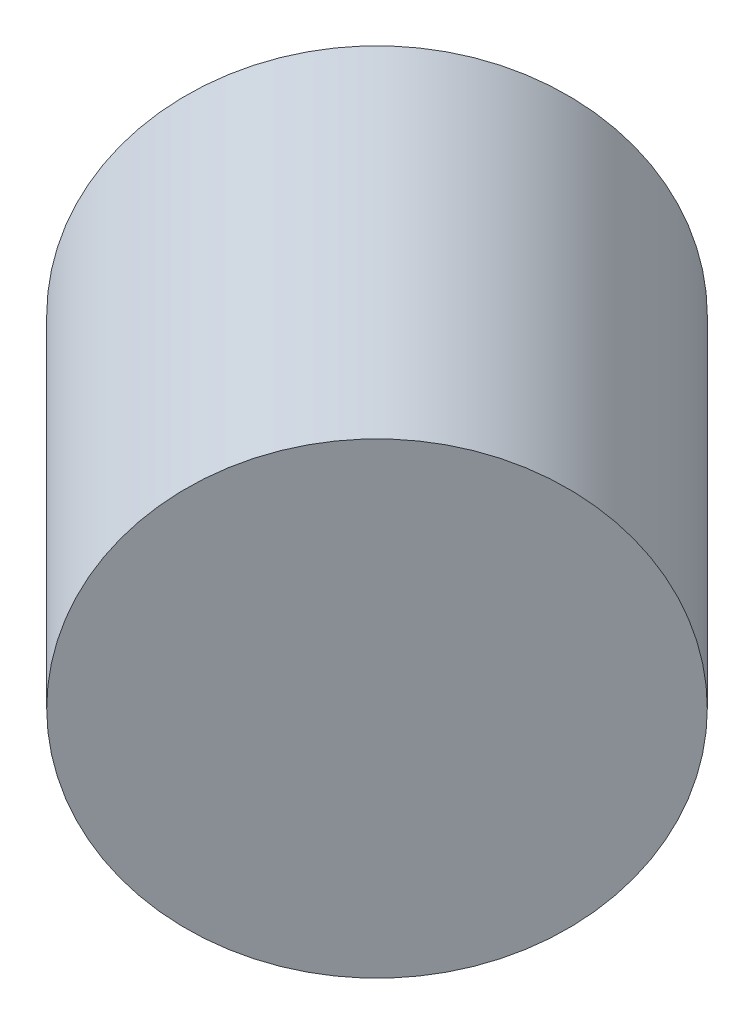
ISO-10303-21;
HEADER;
FILE_DESCRIPTION(('STEP AP214'),'2;1');
FILE_NAME('part.step','',(''),(''),'','','');
FILE_SCHEMA(('AUTOMOTIVE_DESIGN { 1 0 10303 214 1 1 1 1 }'));
ENDSEC;
DATA;
#1=APPLICATION_CONTEXT('core data for automotive mechanical design processes');
#2=APPLICATION_PROTOCOL_DEFINITION('international standard','automotive_design',2000,#1);
#3=PRODUCT_CONTEXT('',#1,'mechanical');
#4=PRODUCT('Part','Part','',(#3));
#5=PRODUCT_RELATED_PRODUCT_CATEGORY('part','',(#4));
#6=PRODUCT_DEFINITION_FORMATION('','',#4);
#7=PRODUCT_DEFINITION_CONTEXT('part definition',#1,'design');
#8=PRODUCT_DEFINITION('design','',#6,#7);
#9=PRODUCT_DEFINITION_SHAPE('','',#8);
#10=(LENGTH_UNIT() NAMED_UNIT(*) SI_UNIT(.MILLI.,.METRE.));
#11=(NAMED_UNIT(*) PLANE_ANGLE_UNIT() SI_UNIT($,.RADIAN.));
#12=(NAMED_UNIT(*) SI_UNIT($,.STERADIAN.) SOLID_ANGLE_UNIT());
#13=UNCERTAINTY_MEASURE_WITH_UNIT(LENGTH_MEASURE(1.E-05),#10,'distance_accuracy_value','');
#14=(GEOMETRIC_REPRESENTATION_CONTEXT(3) GLOBAL_UNCERTAINTY_ASSIGNED_CONTEXT((#13)) GLOBAL_UNIT_ASSIGNED_CONTEXT((#10,
#11,#12)) REPRESENTATION_CONTEXT('',''));
#15=CARTESIAN_POINT('',(0.,0.,0.));
#16=DIRECTION('',(0.,0.,1.));
#17=DIRECTION('',(1.,0.,0.));
#18=AXIS2_PLACEMENT_3D('',#15,#16,#17);
#19=CARTESIAN_POINT('',(-310.621119644557,-7.50000000000002,9.22839729542448));
#20=DIRECTION('',(0.707106781186561,0.,0.707106781186534));
#21=DIRECTION('',(0.707106781186534,0.,-0.707106781186561));
#22=AXIS2_PLACEMENT_3D('',#19,#20,#21);
#23=CYLINDRICAL_SURFACE('',#22,48.9999999999983);
#24=CARTESIAN_POINT('',(-310.621119644557,-7.50000000000002,9.22839729542448));
#25=DIRECTION('',(0.707106781186561,0.,0.707106781186534));
#26=DIRECTION('',(0.707106781186534,0.,-0.707106781186561));
#27=AXIS2_PLACEMENT_3D('',#24,#25,#26);
#28=CIRCLE('',#27,48.9999999999983);
#29=CARTESIAN_POINT('',(-275.972887366418,-7.50000000000002,-25.4198349827158));
#30=VERTEX_POINT('',#29);
#31=EDGE_CURVE('E10',#30,#30,#28,.T.);
#32=ORIENTED_EDGE('',*,*,#31,.T.);
#33=EDGE_LOOP('',(#32));
#34=FACE_BOUND('',#33,.T.);
#35=CARTESIAN_POINT('',(-239.203334744714,-7.50000000000002,80.6461821952644));
#36=DIRECTION('',(0.707106781186561,0.,0.707106781186534));
#37=DIRECTION('',(0.707106781186534,0.,-0.707106781186561));
#38=AXIS2_PLACEMENT_3D('',#35,#36,#37);
#39=CIRCLE('',#38,48.9999999999983);
#40=CARTESIAN_POINT('',(-204.555102466575,-7.50000000000002,45.9979499171241));
#41=VERTEX_POINT('',#40);
#42=EDGE_CURVE('E34',#41,#41,#39,.T.);
#43=ORIENTED_EDGE('',*,*,#42,.F.);
#44=EDGE_LOOP('',(#43));
#45=FACE_BOUND('',#44,.T.);
#46=ADVANCED_FACE('F31',(#34,#45),#23,.T.);
#47=CARTESIAN_POINT('',(-310.621119644557,-7.50000000000002,9.22839729542448));
#48=DIRECTION('',(0.707106781186561,0.,0.707106781186534));
#49=DIRECTION('',(0.707106781186534,0.,-0.707106781186561));
#50=AXIS2_PLACEMENT_3D('',#47,#48,#49);
#51=PLANE('',#50);
#52=ORIENTED_EDGE('',*,*,#31,.F.);
#53=EDGE_LOOP('',(#52));
#54=FACE_BOUND('',#53,.T.);
#55=ADVANCED_FACE('F46',(#54),#51,.F.);
#56=CARTESIAN_POINT('',(-239.203334744714,-7.50000000000002,80.6461821952644));
#57=DIRECTION('',(0.707106781186561,0.,0.707106781186534));
#58=DIRECTION('',(0.707106781186534,0.,-0.707106781186561));
#59=AXIS2_PLACEMENT_3D('',#56,#57,#58);
#60=PLANE('',#59);
#61=ORIENTED_EDGE('',*,*,#42,.T.);
#62=EDGE_LOOP('',(#61));
#63=FACE_BOUND('',#62,.T.);
#64=ADVANCED_FACE('F43',(#63),#60,.T.);
#65=CLOSED_SHELL('',(#46,#55,#64));
#66=MANIFOLD_SOLID_BREP('B2',#65);
#67=ADVANCED_BREP_SHAPE_REPRESENTATION('',(#18,#66),#14);
#68=SHAPE_DEFINITION_REPRESENTATION(#9,#67);
ENDSEC;
END-ISO-10303-21;
